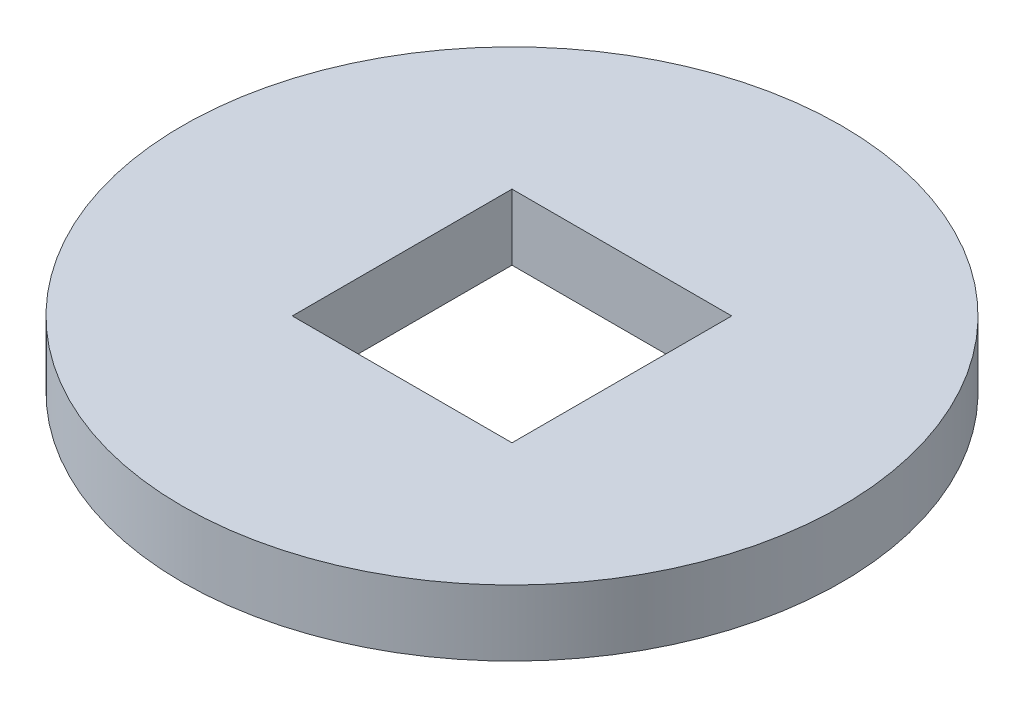
ISO-10303-21;
HEADER;
FILE_DESCRIPTION(('STEP AP214'),'2;1');
FILE_NAME('part.step','',(''),(''),'','','');
FILE_SCHEMA(('AUTOMOTIVE_DESIGN { 1 0 10303 214 1 1 1 1 }'));
ENDSEC;
DATA;
#1=APPLICATION_CONTEXT('core data for automotive mechanical design processes');
#2=APPLICATION_PROTOCOL_DEFINITION('international standard','automotive_design',2000,#1);
#3=PRODUCT_CONTEXT('',#1,'mechanical');
#4=PRODUCT('Part','Part','',(#3));
#5=PRODUCT_RELATED_PRODUCT_CATEGORY('part','',(#4));
#6=PRODUCT_DEFINITION_FORMATION('','',#4);
#7=PRODUCT_DEFINITION_CONTEXT('part definition',#1,'design');
#8=PRODUCT_DEFINITION('design','',#6,#7);
#9=PRODUCT_DEFINITION_SHAPE('','',#8);
#10=(LENGTH_UNIT() NAMED_UNIT(*) SI_UNIT(.MILLI.,.METRE.));
#11=(NAMED_UNIT(*) PLANE_ANGLE_UNIT() SI_UNIT($,.RADIAN.));
#12=(NAMED_UNIT(*) SI_UNIT($,.STERADIAN.) SOLID_ANGLE_UNIT());
#13=UNCERTAINTY_MEASURE_WITH_UNIT(LENGTH_MEASURE(1.E-05),#10,'distance_accuracy_value','');
#14=(GEOMETRIC_REPRESENTATION_CONTEXT(3) GLOBAL_UNCERTAINTY_ASSIGNED_CONTEXT((#13)) GLOBAL_UNIT_ASSIGNED_CONTEXT((#10,
#11,#12)) REPRESENTATION_CONTEXT('',''));
#15=CARTESIAN_POINT('',(0.,0.,0.));
#16=DIRECTION('',(0.,0.,1.));
#17=DIRECTION('',(1.,0.,0.));
#18=AXIS2_PLACEMENT_3D('',#15,#16,#17);
#19=CARTESIAN_POINT('',(0.,6.,0.));
#20=DIRECTION('',(0.,1.,0.));
#21=DIRECTION('',(0.,0.,1.));
#22=AXIS2_PLACEMENT_3D('',#19,#20,#21);
#23=PLANE('',#22);
#24=CARTESIAN_POINT('',(0.,6.,0.));
#25=DIRECTION('',(0.,1.,0.));
#26=DIRECTION('',(0.,0.,1.));
#27=AXIS2_PLACEMENT_3D('',#24,#25,#26);
#28=CIRCLE('',#27,30.);
#29=CARTESIAN_POINT('',(0.,6.,30.));
#30=VERTEX_POINT('',#29);
#31=EDGE_CURVE('E11',#30,#30,#28,.T.);
#32=ORIENTED_EDGE('',*,*,#31,.T.);
#33=EDGE_LOOP('',(#32));
#34=FACE_BOUND('',#33,.T.);
#35=DIRECTION('',(-1.,0.,0.));
#36=VECTOR('',#35,1.);
#37=CARTESIAN_POINT('',(-10.,6.,-10.));
#38=LINE('',#37,#36);
#39=CARTESIAN_POINT('',(10.,6.,-10.));
#40=VERTEX_POINT('',#39);
#41=CARTESIAN_POINT('',(-10.,6.,-10.));
#42=VERTEX_POINT('',#41);
#43=EDGE_CURVE('E84',#40,#42,#38,.T.);
#44=ORIENTED_EDGE('',*,*,#43,.F.);
#45=DIRECTION('',(0.,0.,-1.));
#46=VECTOR('',#45,1.);
#47=CARTESIAN_POINT('',(10.,6.,10.));
#48=LINE('',#47,#46);
#49=CARTESIAN_POINT('',(10.,6.,10.));
#50=VERTEX_POINT('',#49);
#51=EDGE_CURVE('E76',#50,#40,#48,.T.);
#52=ORIENTED_EDGE('',*,*,#51,.F.);
#53=DIRECTION('',(1.,0.,0.));
#54=VECTOR('',#53,1.);
#55=CARTESIAN_POINT('',(-10.,6.,10.));
#56=LINE('',#55,#54);
#57=CARTESIAN_POINT('',(-10.,6.,10.));
#58=VERTEX_POINT('',#57);
#59=EDGE_CURVE('E97',#58,#50,#56,.T.);
#60=ORIENTED_EDGE('',*,*,#59,.F.);
#61=DIRECTION('',(0.,0.,1.));
#62=VECTOR('',#61,1.);
#63=CARTESIAN_POINT('',(-10.,6.,10.));
#64=LINE('',#63,#62);
#65=EDGE_CURVE('E95',#42,#58,#64,.T.);
#66=ORIENTED_EDGE('',*,*,#65,.F.);
#67=EDGE_LOOP('',(#44,#52,#60,#66));
#68=FACE_BOUND('',#67,.T.);
#69=ADVANCED_FACE('F35',(#34,#68),#23,.T.);
#70=CARTESIAN_POINT('',(0.,0.,0.));
#71=DIRECTION('',(0.,1.,0.));
#72=DIRECTION('',(0.,0.,1.));
#73=AXIS2_PLACEMENT_3D('',#70,#71,#72);
#74=PLANE('',#73);
#75=CARTESIAN_POINT('',(0.,0.,0.));
#76=DIRECTION('',(0.,1.,0.));
#77=DIRECTION('',(0.,0.,1.));
#78=AXIS2_PLACEMENT_3D('',#75,#76,#77);
#79=CIRCLE('',#78,30.);
#80=CARTESIAN_POINT('',(0.,0.,30.));
#81=VERTEX_POINT('',#80);
#82=EDGE_CURVE('E39',#81,#81,#79,.T.);
#83=ORIENTED_EDGE('',*,*,#82,.F.);
#84=EDGE_LOOP('',(#83));
#85=FACE_BOUND('',#84,.T.);
#86=DIRECTION('',(0.,0.,-1.));
#87=VECTOR('',#86,1.);
#88=CARTESIAN_POINT('',(10.,0.,10.));
#89=LINE('',#88,#87);
#90=CARTESIAN_POINT('',(10.,0.,10.));
#91=VERTEX_POINT('',#90);
#92=CARTESIAN_POINT('',(10.,0.,-10.));
#93=VERTEX_POINT('',#92);
#94=EDGE_CURVE('E58',#91,#93,#89,.T.);
#95=ORIENTED_EDGE('',*,*,#94,.T.);
#96=DIRECTION('',(-1.,0.,0.));
#97=VECTOR('',#96,1.);
#98=CARTESIAN_POINT('',(-10.,0.,-10.));
#99=LINE('',#98,#97);
#100=CARTESIAN_POINT('',(-10.,0.,-10.));
#101=VERTEX_POINT('',#100);
#102=EDGE_CURVE('E91',#93,#101,#99,.T.);
#103=ORIENTED_EDGE('',*,*,#102,.T.);
#104=DIRECTION('',(0.,0.,1.));
#105=VECTOR('',#104,1.);
#106=CARTESIAN_POINT('',(-10.,0.,10.));
#107=LINE('',#106,#105);
#108=CARTESIAN_POINT('',(-10.,0.,10.));
#109=VERTEX_POINT('',#108);
#110=EDGE_CURVE('E103',#101,#109,#107,.T.);
#111=ORIENTED_EDGE('',*,*,#110,.T.);
#112=DIRECTION('',(1.,0.,0.));
#113=VECTOR('',#112,1.);
#114=CARTESIAN_POINT('',(-10.,0.,10.));
#115=LINE('',#114,#113);
#116=EDGE_CURVE('E85',#109,#91,#115,.T.);
#117=ORIENTED_EDGE('',*,*,#116,.T.);
#118=EDGE_LOOP('',(#95,#103,#111,#117));
#119=FACE_BOUND('',#118,.T.);
#120=ADVANCED_FACE('F114',(#85,#119),#74,.F.);
#121=CARTESIAN_POINT('',(0.,6.,0.));
#122=DIRECTION('',(0.,-1.,0.));
#123=DIRECTION('',(0.,0.,-1.));
#124=AXIS2_PLACEMENT_3D('',#121,#122,#123);
#125=CYLINDRICAL_SURFACE('',#124,30.);
#126=ORIENTED_EDGE('',*,*,#31,.F.);
#127=EDGE_LOOP('',(#126));
#128=FACE_BOUND('',#127,.T.);
#129=ORIENTED_EDGE('',*,*,#82,.T.);
#130=EDGE_LOOP('',(#129));
#131=FACE_BOUND('',#130,.T.);
#132=ADVANCED_FACE('F37',(#128,#131),#125,.T.);
#133=CARTESIAN_POINT('',(10.,6.,10.));
#134=DIRECTION('',(-1.,0.,0.));
#135=DIRECTION('',(0.,0.,1.));
#136=AXIS2_PLACEMENT_3D('',#133,#134,#135);
#137=PLANE('',#136);
#138=ORIENTED_EDGE('',*,*,#94,.F.);
#139=DIRECTION('',(0.,-1.,0.));
#140=VECTOR('',#139,1.);
#141=CARTESIAN_POINT('',(10.,6.,10.));
#142=LINE('',#141,#140);
#143=EDGE_CURVE('E80',#50,#91,#142,.T.);
#144=ORIENTED_EDGE('',*,*,#143,.F.);
#145=ORIENTED_EDGE('',*,*,#51,.T.);
#146=DIRECTION('',(0.,-1.,0.));
#147=VECTOR('',#146,1.);
#148=CARTESIAN_POINT('',(10.,6.,-10.));
#149=LINE('',#148,#147);
#150=EDGE_CURVE('E79',#40,#93,#149,.T.);
#151=ORIENTED_EDGE('',*,*,#150,.T.);
#152=EDGE_LOOP('',(#138,#144,#145,#151));
#153=FACE_BOUND('',#152,.T.);
#154=ADVANCED_FACE('F78',(#153),#137,.T.);
#155=CARTESIAN_POINT('',(-10.,6.,-10.));
#156=DIRECTION('',(0.,0.,1.));
#157=DIRECTION('',(1.,0.,0.));
#158=AXIS2_PLACEMENT_3D('',#155,#156,#157);
#159=PLANE('',#158);
#160=ORIENTED_EDGE('',*,*,#102,.F.);
#161=ORIENTED_EDGE('',*,*,#150,.F.);
#162=ORIENTED_EDGE('',*,*,#43,.T.);
#163=DIRECTION('',(0.,-1.,0.));
#164=VECTOR('',#163,1.);
#165=CARTESIAN_POINT('',(-10.,6.,-10.));
#166=LINE('',#165,#164);
#167=EDGE_CURVE('E92',#42,#101,#166,.T.);
#168=ORIENTED_EDGE('',*,*,#167,.T.);
#169=EDGE_LOOP('',(#160,#161,#162,#168));
#170=FACE_BOUND('',#169,.T.);
#171=ADVANCED_FACE('F88',(#170),#159,.T.);
#172=CARTESIAN_POINT('',(-10.,6.,10.));
#173=DIRECTION('',(1.,0.,0.));
#174=DIRECTION('',(0.,0.,-1.));
#175=AXIS2_PLACEMENT_3D('',#172,#173,#174);
#176=PLANE('',#175);
#177=ORIENTED_EDGE('',*,*,#110,.F.);
#178=ORIENTED_EDGE('',*,*,#167,.F.);
#179=ORIENTED_EDGE('',*,*,#65,.T.);
#180=DIRECTION('',(0.,-1.,0.));
#181=VECTOR('',#180,1.);
#182=CARTESIAN_POINT('',(-10.,6.,10.));
#183=LINE('',#182,#181);
#184=EDGE_CURVE('E50',#58,#109,#183,.T.);
#185=ORIENTED_EDGE('',*,*,#184,.T.);
#186=EDGE_LOOP('',(#177,#178,#179,#185));
#187=FACE_BOUND('',#186,.T.);
#188=ADVANCED_FACE('F112',(#187),#176,.T.);
#189=CARTESIAN_POINT('',(-10.,6.,10.));
#190=DIRECTION('',(0.,0.,-1.));
#191=DIRECTION('',(-1.,0.,0.));
#192=AXIS2_PLACEMENT_3D('',#189,#190,#191);
#193=PLANE('',#192);
#194=ORIENTED_EDGE('',*,*,#116,.F.);
#195=ORIENTED_EDGE('',*,*,#184,.F.);
#196=ORIENTED_EDGE('',*,*,#59,.T.);
#197=ORIENTED_EDGE('',*,*,#143,.T.);
#198=EDGE_LOOP('',(#194,#195,#196,#197));
#199=FACE_BOUND('',#198,.T.);
#200=ADVANCED_FACE('F115',(#199),#193,.T.);
#201=CLOSED_SHELL('',(#69,#120,#132,#154,#171,#188,#200));
#202=MANIFOLD_SOLID_BREP('B2',#201);
#203=ADVANCED_BREP_SHAPE_REPRESENTATION('',(#18,#202),#14);
#204=SHAPE_DEFINITION_REPRESENTATION(#9,#203);
ENDSEC;
END-ISO-10303-21;
